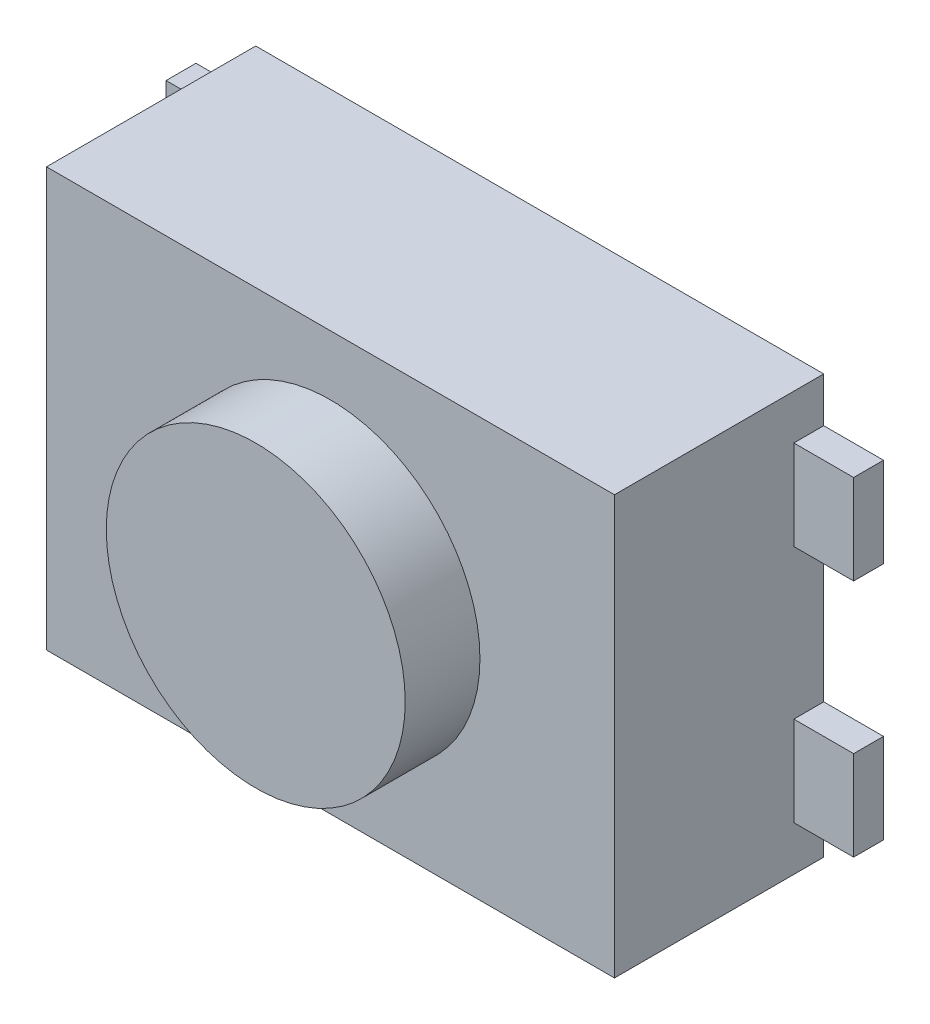
ISO-10303-21;
HEADER;
FILE_DESCRIPTION(('STEP AP214'),'2;1');
FILE_NAME('part.step','',(''),(''),'','','');
FILE_SCHEMA(('AUTOMOTIVE_DESIGN { 1 0 10303 214 1 1 1 1 }'));
ENDSEC;
DATA;
#1=APPLICATION_CONTEXT('core data for automotive mechanical design processes');
#2=APPLICATION_PROTOCOL_DEFINITION('international standard','automotive_design',2000,#1);
#3=PRODUCT_CONTEXT('',#1,'mechanical');
#4=PRODUCT('Part','Part','',(#3));
#5=PRODUCT_RELATED_PRODUCT_CATEGORY('part','',(#4));
#6=PRODUCT_DEFINITION_FORMATION('','',#4);
#7=PRODUCT_DEFINITION_CONTEXT('part definition',#1,'design');
#8=PRODUCT_DEFINITION('design','',#6,#7);
#9=PRODUCT_DEFINITION_SHAPE('','',#8);
#10=(LENGTH_UNIT() NAMED_UNIT(*) SI_UNIT(.MILLI.,.METRE.));
#11=(NAMED_UNIT(*) PLANE_ANGLE_UNIT() SI_UNIT($,.RADIAN.));
#12=(NAMED_UNIT(*) SI_UNIT($,.STERADIAN.) SOLID_ANGLE_UNIT());
#13=UNCERTAINTY_MEASURE_WITH_UNIT(LENGTH_MEASURE(1.E-05),#10,'distance_accuracy_value','');
#14=(GEOMETRIC_REPRESENTATION_CONTEXT(3) GLOBAL_UNCERTAINTY_ASSIGNED_CONTEXT((#13)) GLOBAL_UNIT_ASSIGNED_CONTEXT((#10,
#11,#12)) REPRESENTATION_CONTEXT('',''));
#15=CARTESIAN_POINT('',(0.,0.,0.));
#16=DIRECTION('',(0.,0.,1.));
#17=DIRECTION('',(1.,0.,0.));
#18=AXIS2_PLACEMENT_3D('',#15,#16,#17);
#19=CARTESIAN_POINT('',(2.1,0.8,0.));
#20=DIRECTION('',(0.,0.,1.));
#21=DIRECTION('',(1.,0.,0.));
#22=AXIS2_PLACEMENT_3D('',#19,#20,#21);
#23=PLANE('',#22);
#24=DIRECTION('',(-1.,0.,0.));
#25=VECTOR('',#24,1.);
#26=CARTESIAN_POINT('',(2.3,1.1,0.));
#27=LINE('',#26,#25);
#28=CARTESIAN_POINT('',(2.3,1.1,0.));
#29=VERTEX_POINT('',#28);
#30=CARTESIAN_POINT('',(1.9,1.1,0.));
#31=VERTEX_POINT('',#30);
#32=EDGE_CURVE('P0_E78',#29,#31,#27,.T.);
#33=ORIENTED_EDGE('',*,*,#32,.F.);
#34=DIRECTION('',(0.,1.,0.));
#35=VECTOR('',#34,1.);
#36=CARTESIAN_POINT('',(2.3,0.5,0.));
#37=LINE('',#36,#35);
#38=CARTESIAN_POINT('',(2.3,0.5,0.));
#39=VERTEX_POINT('',#38);
#40=EDGE_CURVE('P0_E54',#39,#29,#37,.T.);
#41=ORIENTED_EDGE('',*,*,#40,.F.);
#42=DIRECTION('',(1.,0.,0.));
#43=VECTOR('',#42,1.);
#44=CARTESIAN_POINT('',(1.9,0.5,0.));
#45=LINE('',#44,#43);
#46=CARTESIAN_POINT('',(1.9,0.5,0.));
#47=VERTEX_POINT('',#46);
#48=EDGE_CURVE('P0_E56',#47,#39,#45,.T.);
#49=ORIENTED_EDGE('',*,*,#48,.F.);
#50=DIRECTION('',(0.,1.,0.));
#51=VECTOR('',#50,1.);
#52=CARTESIAN_POINT('',(1.9,1.1,0.));
#53=LINE('',#52,#51);
#54=EDGE_CURVE('P0_E19',#31,#47,#53,.F.);
#55=ORIENTED_EDGE('',*,*,#54,.F.);
#56=EDGE_LOOP('',(#33,#41,#49,#55));
#57=FACE_BOUND('',#56,.T.);
#58=ADVANCED_FACE('P0_F16',(#57),#23,.F.);
#59=CARTESIAN_POINT('',(1.9,1.1,0.));
#60=DIRECTION('',(-1.,0.,0.));
#61=DIRECTION('',(0.,0.,1.));
#62=AXIS2_PLACEMENT_3D('',#59,#60,#61);
#63=PLANE('',#62);
#64=DIRECTION('',(0.,1.,0.));
#65=VECTOR('',#64,1.);
#66=CARTESIAN_POINT('',(1.9,0.8,0.2));
#67=LINE('',#66,#65);
#68=CARTESIAN_POINT('',(1.9,1.1,0.2));
#69=VERTEX_POINT('',#68);
#70=CARTESIAN_POINT('',(1.9,0.5,0.2));
#71=VERTEX_POINT('',#70);
#72=EDGE_CURVE('P0_E82',#69,#71,#67,.F.);
#73=ORIENTED_EDGE('',*,*,#72,.F.);
#74=DIRECTION('',(0.,0.,1.));
#75=VECTOR('',#74,1.);
#76=CARTESIAN_POINT('',(1.9,1.1,0.));
#77=LINE('',#76,#75);
#78=EDGE_CURVE('P0_E67',#31,#69,#77,.T.);
#79=ORIENTED_EDGE('',*,*,#78,.F.);
#80=ORIENTED_EDGE('',*,*,#54,.T.);
#81=DIRECTION('',(0.,0.,-1.));
#82=VECTOR('',#81,1.);
#83=CARTESIAN_POINT('',(1.9,0.5,0.));
#84=LINE('',#83,#82);
#85=EDGE_CURVE('P0_E62',#71,#47,#84,.T.);
#86=ORIENTED_EDGE('',*,*,#85,.F.);
#87=EDGE_LOOP('',(#73,#79,#80,#86));
#88=FACE_BOUND('',#87,.T.);
#89=ADVANCED_FACE('P0_F64',(#88),#63,.T.);
#90=CARTESIAN_POINT('',(1.9,0.5,0.));
#91=DIRECTION('',(0.,-1.,0.));
#92=DIRECTION('',(0.,0.,-1.));
#93=AXIS2_PLACEMENT_3D('',#90,#91,#92);
#94=PLANE('',#93);
#95=DIRECTION('',(1.,0.,0.));
#96=VECTOR('',#95,1.);
#97=CARTESIAN_POINT('',(2.1,0.5,0.2));
#98=LINE('',#97,#96);
#99=CARTESIAN_POINT('',(2.3,0.5,0.2));
#100=VERTEX_POINT('',#99);
#101=EDGE_CURVE('P0_E71',#71,#100,#98,.T.);
#102=ORIENTED_EDGE('',*,*,#101,.F.);
#103=ORIENTED_EDGE('',*,*,#85,.T.);
#104=ORIENTED_EDGE('',*,*,#48,.T.);
#105=DIRECTION('',(0.,0.,-1.));
#106=VECTOR('',#105,1.);
#107=CARTESIAN_POINT('',(2.3,0.5,0.));
#108=LINE('',#107,#106);
#109=EDGE_CURVE('P0_E74',#100,#39,#108,.T.);
#110=ORIENTED_EDGE('',*,*,#109,.F.);
#111=EDGE_LOOP('',(#102,#103,#104,#110));
#112=FACE_BOUND('',#111,.T.);
#113=ADVANCED_FACE('P0_F69',(#112),#94,.T.);
#114=CARTESIAN_POINT('',(2.3,0.5,0.));
#115=DIRECTION('',(1.,0.,0.));
#116=DIRECTION('',(0.,0.,-1.));
#117=AXIS2_PLACEMENT_3D('',#114,#115,#116);
#118=PLANE('',#117);
#119=DIRECTION('',(0.,1.,0.));
#120=VECTOR('',#119,1.);
#121=CARTESIAN_POINT('',(2.3,0.8,0.2));
#122=LINE('',#121,#120);
#123=CARTESIAN_POINT('',(2.3,1.1,0.2));
#124=VERTEX_POINT('',#123);
#125=EDGE_CURVE('P0_E25',#100,#124,#122,.T.);
#126=ORIENTED_EDGE('',*,*,#125,.F.);
#127=ORIENTED_EDGE('',*,*,#109,.T.);
#128=ORIENTED_EDGE('',*,*,#40,.T.);
#129=DIRECTION('',(0.,0.,1.));
#130=VECTOR('',#129,1.);
#131=CARTESIAN_POINT('',(2.3,1.1,0.));
#132=LINE('',#131,#130);
#133=EDGE_CURVE('P0_E34',#124,#29,#132,.F.);
#134=ORIENTED_EDGE('',*,*,#133,.F.);
#135=EDGE_LOOP('',(#126,#127,#128,#134));
#136=FACE_BOUND('',#135,.T.);
#137=ADVANCED_FACE('P0_F88',(#136),#118,.T.);
#138=CARTESIAN_POINT('',(2.3,1.1,0.));
#139=DIRECTION('',(0.,1.,0.));
#140=DIRECTION('',(-1.,0.,0.));
#141=AXIS2_PLACEMENT_3D('',#138,#139,#140);
#142=PLANE('',#141);
#143=DIRECTION('',(1.,0.,0.));
#144=VECTOR('',#143,1.);
#145=CARTESIAN_POINT('',(2.1,1.1,0.2));
#146=LINE('',#145,#144);
#147=EDGE_CURVE('P0_E11',#124,#69,#146,.F.);
#148=ORIENTED_EDGE('',*,*,#147,.F.);
#149=ORIENTED_EDGE('',*,*,#133,.T.);
#150=ORIENTED_EDGE('',*,*,#32,.T.);
#151=ORIENTED_EDGE('',*,*,#78,.T.);
#152=EDGE_LOOP('',(#148,#149,#150,#151));
#153=FACE_BOUND('',#152,.T.);
#154=ADVANCED_FACE('P0_F90',(#153),#142,.T.);
#155=CARTESIAN_POINT('',(2.1,0.8,0.2));
#156=DIRECTION('',(0.,0.,1.));
#157=DIRECTION('',(1.,0.,0.));
#158=AXIS2_PLACEMENT_3D('',#155,#156,#157);
#159=PLANE('',#158);
#160=ORIENTED_EDGE('',*,*,#125,.T.);
#161=ORIENTED_EDGE('',*,*,#147,.T.);
#162=ORIENTED_EDGE('',*,*,#72,.T.);
#163=ORIENTED_EDGE('',*,*,#101,.T.);
#164=EDGE_LOOP('',(#160,#161,#162,#163));
#165=FACE_BOUND('',#164,.T.);
#166=ADVANCED_FACE('P0_F87',(#165),#159,.T.);
#167=CLOSED_SHELL('',(#58,#89,#113,#137,#154,#166));
#168=MANIFOLD_SOLID_BREP('P0_B1',#167);
#169=CARTESIAN_POINT('',(-2.1,-0.8,0.));
#170=DIRECTION('',(0.,0.,1.));
#171=DIRECTION('',(1.,0.,0.));
#172=AXIS2_PLACEMENT_3D('',#169,#170,#171);
#173=PLANE('',#172);
#174=DIRECTION('',(1.,0.,0.));
#175=VECTOR('',#174,1.);
#176=CARTESIAN_POINT('',(-2.3,-1.1,0.));
#177=LINE('',#176,#175);
#178=CARTESIAN_POINT('',(-2.3,-1.1,0.));
#179=VERTEX_POINT('',#178);
#180=CARTESIAN_POINT('',(-1.9,-1.1,0.));
#181=VERTEX_POINT('',#180);
#182=EDGE_CURVE('P1_E78',#179,#181,#177,.T.);
#183=ORIENTED_EDGE('',*,*,#182,.F.);
#184=DIRECTION('',(0.,-1.,0.));
#185=VECTOR('',#184,1.);
#186=CARTESIAN_POINT('',(-2.3,-0.500000000000001,0.));
#187=LINE('',#186,#185);
#188=CARTESIAN_POINT('',(-2.3,-0.500000000000001,0.));
#189=VERTEX_POINT('',#188);
#190=EDGE_CURVE('P1_E54',#189,#179,#187,.T.);
#191=ORIENTED_EDGE('',*,*,#190,.F.);
#192=DIRECTION('',(-1.,0.,0.));
#193=VECTOR('',#192,1.);
#194=CARTESIAN_POINT('',(-1.9,-0.500000000000001,0.));
#195=LINE('',#194,#193);
#196=CARTESIAN_POINT('',(-1.9,-0.500000000000001,0.));
#197=VERTEX_POINT('',#196);
#198=EDGE_CURVE('P1_E56',#197,#189,#195,.T.);
#199=ORIENTED_EDGE('',*,*,#198,.F.);
#200=DIRECTION('',(0.,1.,0.));
#201=VECTOR('',#200,1.);
#202=CARTESIAN_POINT('',(-1.9,-1.1,0.));
#203=LINE('',#202,#201);
#204=EDGE_CURVE('P1_E19',#181,#197,#203,.T.);
#205=ORIENTED_EDGE('',*,*,#204,.F.);
#206=EDGE_LOOP('',(#183,#191,#199,#205));
#207=FACE_BOUND('',#206,.T.);
#208=ADVANCED_FACE('P1_F16',(#207),#173,.F.);
#209=CARTESIAN_POINT('',(-1.9,-1.1,0.));
#210=DIRECTION('',(1.,0.,0.));
#211=DIRECTION('',(0.,0.,-1.));
#212=AXIS2_PLACEMENT_3D('',#209,#210,#211);
#213=PLANE('',#212);
#214=DIRECTION('',(0.,1.,0.));
#215=VECTOR('',#214,1.);
#216=CARTESIAN_POINT('',(-1.9,-0.8,0.2));
#217=LINE('',#216,#215);
#218=CARTESIAN_POINT('',(-1.9,-1.1,0.2));
#219=VERTEX_POINT('',#218);
#220=CARTESIAN_POINT('',(-1.9,-0.500000000000001,0.2));
#221=VERTEX_POINT('',#220);
#222=EDGE_CURVE('P1_E82',#219,#221,#217,.T.);
#223=ORIENTED_EDGE('',*,*,#222,.F.);
#224=DIRECTION('',(0.,0.,-1.));
#225=VECTOR('',#224,1.);
#226=CARTESIAN_POINT('',(-1.9,-1.1,0.));
#227=LINE('',#226,#225);
#228=EDGE_CURVE('P1_E67',#181,#219,#227,.F.);
#229=ORIENTED_EDGE('',*,*,#228,.F.);
#230=ORIENTED_EDGE('',*,*,#204,.T.);
#231=DIRECTION('',(0.,0.,1.));
#232=VECTOR('',#231,1.);
#233=CARTESIAN_POINT('',(-1.9,-0.500000000000001,0.));
#234=LINE('',#233,#232);
#235=EDGE_CURVE('P1_E62',#221,#197,#234,.F.);
#236=ORIENTED_EDGE('',*,*,#235,.F.);
#237=EDGE_LOOP('',(#223,#229,#230,#236));
#238=FACE_BOUND('',#237,.T.);
#239=ADVANCED_FACE('P1_F64',(#238),#213,.T.);
#240=CARTESIAN_POINT('',(-1.9,-0.500000000000001,0.));
#241=DIRECTION('',(0.,1.,0.));
#242=DIRECTION('',(-1.,0.,0.));
#243=AXIS2_PLACEMENT_3D('',#240,#241,#242);
#244=PLANE('',#243);
#245=DIRECTION('',(1.,0.,0.));
#246=VECTOR('',#245,1.);
#247=CARTESIAN_POINT('',(-2.1,-0.500000000000001,0.2));
#248=LINE('',#247,#246);
#249=CARTESIAN_POINT('',(-2.3,-0.500000000000001,0.2));
#250=VERTEX_POINT('',#249);
#251=EDGE_CURVE('P1_E71',#221,#250,#248,.F.);
#252=ORIENTED_EDGE('',*,*,#251,.F.);
#253=ORIENTED_EDGE('',*,*,#235,.T.);
#254=ORIENTED_EDGE('',*,*,#198,.T.);
#255=DIRECTION('',(0.,0.,1.));
#256=VECTOR('',#255,1.);
#257=CARTESIAN_POINT('',(-2.3,-0.500000000000001,0.));
#258=LINE('',#257,#256);
#259=EDGE_CURVE('P1_E74',#250,#189,#258,.F.);
#260=ORIENTED_EDGE('',*,*,#259,.F.);
#261=EDGE_LOOP('',(#252,#253,#254,#260));
#262=FACE_BOUND('',#261,.T.);
#263=ADVANCED_FACE('P1_F69',(#262),#244,.T.);
#264=CARTESIAN_POINT('',(-2.3,-0.500000000000001,0.));
#265=DIRECTION('',(-1.,0.,0.));
#266=DIRECTION('',(0.,-1.,0.));
#267=AXIS2_PLACEMENT_3D('',#264,#265,#266);
#268=PLANE('',#267);
#269=DIRECTION('',(0.,1.,0.));
#270=VECTOR('',#269,1.);
#271=CARTESIAN_POINT('',(-2.3,-0.8,0.2));
#272=LINE('',#271,#270);
#273=CARTESIAN_POINT('',(-2.3,-1.1,0.2));
#274=VERTEX_POINT('',#273);
#275=EDGE_CURVE('P1_E25',#250,#274,#272,.F.);
#276=ORIENTED_EDGE('',*,*,#275,.F.);
#277=ORIENTED_EDGE('',*,*,#259,.T.);
#278=ORIENTED_EDGE('',*,*,#190,.T.);
#279=DIRECTION('',(0.,0.,-1.));
#280=VECTOR('',#279,1.);
#281=CARTESIAN_POINT('',(-2.3,-1.1,0.));
#282=LINE('',#281,#280);
#283=EDGE_CURVE('P1_E34',#274,#179,#282,.T.);
#284=ORIENTED_EDGE('',*,*,#283,.F.);
#285=EDGE_LOOP('',(#276,#277,#278,#284));
#286=FACE_BOUND('',#285,.T.);
#287=ADVANCED_FACE('P1_F88',(#286),#268,.T.);
#288=CARTESIAN_POINT('',(-2.3,-1.1,0.));
#289=DIRECTION('',(0.,-1.,0.));
#290=DIRECTION('',(0.,0.,-1.));
#291=AXIS2_PLACEMENT_3D('',#288,#289,#290);
#292=PLANE('',#291);
#293=DIRECTION('',(1.,0.,0.));
#294=VECTOR('',#293,1.);
#295=CARTESIAN_POINT('',(-2.1,-1.1,0.2));
#296=LINE('',#295,#294);
#297=EDGE_CURVE('P1_E11',#274,#219,#296,.T.);
#298=ORIENTED_EDGE('',*,*,#297,.F.);
#299=ORIENTED_EDGE('',*,*,#283,.T.);
#300=ORIENTED_EDGE('',*,*,#182,.T.);
#301=ORIENTED_EDGE('',*,*,#228,.T.);
#302=EDGE_LOOP('',(#298,#299,#300,#301));
#303=FACE_BOUND('',#302,.T.);
#304=ADVANCED_FACE('P1_F90',(#303),#292,.T.);
#305=CARTESIAN_POINT('',(-2.1,-0.8,0.2));
#306=DIRECTION('',(0.,0.,1.));
#307=DIRECTION('',(1.,0.,0.));
#308=AXIS2_PLACEMENT_3D('',#305,#306,#307);
#309=PLANE('',#308);
#310=ORIENTED_EDGE('',*,*,#275,.T.);
#311=ORIENTED_EDGE('',*,*,#297,.T.);
#312=ORIENTED_EDGE('',*,*,#222,.T.);
#313=ORIENTED_EDGE('',*,*,#251,.T.);
#314=EDGE_LOOP('',(#310,#311,#312,#313));
#315=FACE_BOUND('',#314,.T.);
#316=ADVANCED_FACE('P1_F87',(#315),#309,.T.);
#317=CLOSED_SHELL('',(#208,#239,#263,#287,#304,#316));
#318=MANIFOLD_SOLID_BREP('P1_B1',#317);
#319=CARTESIAN_POINT('',(0.,0.,1.9));
#320=DIRECTION('',(0.,0.,1.));
#321=DIRECTION('',(1.,0.,0.));
#322=AXIS2_PLACEMENT_3D('',#319,#320,#321);
#323=PLANE('',#322);
#324=CARTESIAN_POINT('',(0.,0.,1.9));
#325=DIRECTION('',(0.,0.,1.));
#326=DIRECTION('',(1.,0.,0.));
#327=AXIS2_PLACEMENT_3D('',#324,#325,#326);
#328=CIRCLE('',#327,1.);
#329=CARTESIAN_POINT('',(1.,0.,1.9));
#330=VERTEX_POINT('',#329);
#331=EDGE_CURVE('P2_E17',#330,#330,#328,.F.);
#332=ORIENTED_EDGE('',*,*,#331,.F.);
#333=EDGE_LOOP('',(#332));
#334=FACE_BOUND('',#333,.T.);
#335=ADVANCED_FACE('P2_F14',(#334),#323,.T.);
#336=CARTESIAN_POINT('',(0.,0.,1.4));
#337=DIRECTION('',(0.,0.,1.));
#338=DIRECTION('',(1.,0.,0.));
#339=AXIS2_PLACEMENT_3D('',#336,#337,#338);
#340=PLANE('',#339);
#341=CARTESIAN_POINT('',(0.,0.,1.4));
#342=DIRECTION('',(0.,0.,1.));
#343=DIRECTION('',(1.,0.,0.));
#344=AXIS2_PLACEMENT_3D('',#341,#342,#343);
#345=CIRCLE('',#344,1.);
#346=CARTESIAN_POINT('',(1.,0.,1.4));
#347=VERTEX_POINT('',#346);
#348=EDGE_CURVE('P2_E10',#347,#347,#345,.T.);
#349=ORIENTED_EDGE('',*,*,#348,.F.);
#350=EDGE_LOOP('',(#349));
#351=FACE_BOUND('',#350,.T.);
#352=ADVANCED_FACE('P2_F29',(#351),#340,.F.);
#353=CARTESIAN_POINT('',(0.,0.,1.4));
#354=DIRECTION('',(0.,0.,1.));
#355=DIRECTION('',(1.,0.,0.));
#356=AXIS2_PLACEMENT_3D('',#353,#354,#355);
#357=CYLINDRICAL_SURFACE('',#356,1.);
#358=ORIENTED_EDGE('',*,*,#348,.T.);
#359=EDGE_LOOP('',(#358));
#360=FACE_BOUND('',#359,.T.);
#361=ORIENTED_EDGE('',*,*,#331,.T.);
#362=EDGE_LOOP('',(#361));
#363=FACE_BOUND('',#362,.T.);
#364=ADVANCED_FACE('P2_F26',(#360,#363),#357,.T.);
#365=CLOSED_SHELL('',(#335,#352,#364));
#366=MANIFOLD_SOLID_BREP('P2_B1',#365);
#367=CARTESIAN_POINT('',(2.1,-0.8,0.));
#368=DIRECTION('',(0.,0.,1.));
#369=DIRECTION('',(1.,0.,0.));
#370=AXIS2_PLACEMENT_3D('',#367,#368,#369);
#371=PLANE('',#370);
#372=DIRECTION('',(0.,1.,0.));
#373=VECTOR('',#372,1.);
#374=CARTESIAN_POINT('',(2.3,-1.1,0.));
#375=LINE('',#374,#373);
#376=CARTESIAN_POINT('',(2.3,-1.1,0.));
#377=VERTEX_POINT('',#376);
#378=CARTESIAN_POINT('',(2.3,-0.5,0.));
#379=VERTEX_POINT('',#378);
#380=EDGE_CURVE('P3_E78',#377,#379,#375,.T.);
#381=ORIENTED_EDGE('',*,*,#380,.F.);
#382=DIRECTION('',(1.,0.,0.));
#383=VECTOR('',#382,1.);
#384=CARTESIAN_POINT('',(1.9,-1.1,0.));
#385=LINE('',#384,#383);
#386=CARTESIAN_POINT('',(1.9,-1.1,0.));
#387=VERTEX_POINT('',#386);
#388=EDGE_CURVE('P3_E54',#387,#377,#385,.T.);
#389=ORIENTED_EDGE('',*,*,#388,.F.);
#390=DIRECTION('',(0.,1.,0.));
#391=VECTOR('',#390,1.);
#392=CARTESIAN_POINT('',(1.9,-0.5,0.));
#393=LINE('',#392,#391);
#394=CARTESIAN_POINT('',(1.9,-0.5,0.));
#395=VERTEX_POINT('',#394);
#396=EDGE_CURVE('P3_E56',#395,#387,#393,.F.);
#397=ORIENTED_EDGE('',*,*,#396,.F.);
#398=DIRECTION('',(1.,0.,0.));
#399=VECTOR('',#398,1.);
#400=CARTESIAN_POINT('',(2.3,-0.5,0.));
#401=LINE('',#400,#399);
#402=EDGE_CURVE('P3_E19',#379,#395,#401,.F.);
#403=ORIENTED_EDGE('',*,*,#402,.F.);
#404=EDGE_LOOP('',(#381,#389,#397,#403));
#405=FACE_BOUND('',#404,.T.);
#406=ADVANCED_FACE('P3_F16',(#405),#371,.F.);
#407=CARTESIAN_POINT('',(2.3,-0.5,0.));
#408=DIRECTION('',(0.,1.,0.));
#409=DIRECTION('',(0.,0.,1.));
#410=AXIS2_PLACEMENT_3D('',#407,#408,#409);
#411=PLANE('',#410);
#412=DIRECTION('',(1.,0.,0.));
#413=VECTOR('',#412,1.);
#414=CARTESIAN_POINT('',(2.1,-0.5,0.2));
#415=LINE('',#414,#413);
#416=CARTESIAN_POINT('',(2.3,-0.5,0.2));
#417=VERTEX_POINT('',#416);
#418=CARTESIAN_POINT('',(1.9,-0.5,0.2));
#419=VERTEX_POINT('',#418);
#420=EDGE_CURVE('P3_E82',#417,#419,#415,.F.);
#421=ORIENTED_EDGE('',*,*,#420,.F.);
#422=DIRECTION('',(0.,0.,1.));
#423=VECTOR('',#422,1.);
#424=CARTESIAN_POINT('',(2.3,-0.5,0.));
#425=LINE('',#424,#423);
#426=EDGE_CURVE('P3_E67',#379,#417,#425,.T.);
#427=ORIENTED_EDGE('',*,*,#426,.F.);
#428=ORIENTED_EDGE('',*,*,#402,.T.);
#429=DIRECTION('',(0.,0.,1.));
#430=VECTOR('',#429,1.);
#431=CARTESIAN_POINT('',(1.9,-0.5,0.));
#432=LINE('',#431,#430);
#433=EDGE_CURVE('P3_E62',#419,#395,#432,.F.);
#434=ORIENTED_EDGE('',*,*,#433,.F.);
#435=EDGE_LOOP('',(#421,#427,#428,#434));
#436=FACE_BOUND('',#435,.T.);
#437=ADVANCED_FACE('P3_F64',(#436),#411,.T.);
#438=CARTESIAN_POINT('',(1.9,-0.5,0.));
#439=DIRECTION('',(-1.,0.,0.));
#440=DIRECTION('',(0.,0.,1.));
#441=AXIS2_PLACEMENT_3D('',#438,#439,#440);
#442=PLANE('',#441);
#443=DIRECTION('',(0.,1.,0.));
#444=VECTOR('',#443,1.);
#445=CARTESIAN_POINT('',(1.9,-0.8,0.2));
#446=LINE('',#445,#444);
#447=CARTESIAN_POINT('',(1.9,-1.1,0.2));
#448=VERTEX_POINT('',#447);
#449=EDGE_CURVE('P3_E71',#419,#448,#446,.F.);
#450=ORIENTED_EDGE('',*,*,#449,.F.);
#451=ORIENTED_EDGE('',*,*,#433,.T.);
#452=ORIENTED_EDGE('',*,*,#396,.T.);
#453=DIRECTION('',(0.,0.,1.));
#454=VECTOR('',#453,1.);
#455=CARTESIAN_POINT('',(1.9,-1.1,0.));
#456=LINE('',#455,#454);
#457=EDGE_CURVE('P3_E74',#448,#387,#456,.F.);
#458=ORIENTED_EDGE('',*,*,#457,.F.);
#459=EDGE_LOOP('',(#450,#451,#452,#458));
#460=FACE_BOUND('',#459,.T.);
#461=ADVANCED_FACE('P3_F69',(#460),#442,.T.);
#462=CARTESIAN_POINT('',(1.9,-1.1,0.));
#463=DIRECTION('',(0.,-1.,0.));
#464=DIRECTION('',(1.,0.,0.));
#465=AXIS2_PLACEMENT_3D('',#462,#463,#464);
#466=PLANE('',#465);
#467=DIRECTION('',(1.,0.,0.));
#468=VECTOR('',#467,1.);
#469=CARTESIAN_POINT('',(2.1,-1.1,0.2));
#470=LINE('',#469,#468);
#471=CARTESIAN_POINT('',(2.3,-1.1,0.2));
#472=VERTEX_POINT('',#471);
#473=EDGE_CURVE('P3_E25',#448,#472,#470,.T.);
#474=ORIENTED_EDGE('',*,*,#473,.F.);
#475=ORIENTED_EDGE('',*,*,#457,.T.);
#476=ORIENTED_EDGE('',*,*,#388,.T.);
#477=DIRECTION('',(0.,0.,1.));
#478=VECTOR('',#477,1.);
#479=CARTESIAN_POINT('',(2.3,-1.1,0.));
#480=LINE('',#479,#478);
#481=EDGE_CURVE('P3_E34',#472,#377,#480,.F.);
#482=ORIENTED_EDGE('',*,*,#481,.F.);
#483=EDGE_LOOP('',(#474,#475,#476,#482));
#484=FACE_BOUND('',#483,.T.);
#485=ADVANCED_FACE('P3_F88',(#484),#466,.T.);
#486=CARTESIAN_POINT('',(2.3,-1.1,0.));
#487=DIRECTION('',(1.,0.,0.));
#488=DIRECTION('',(0.,1.,0.));
#489=AXIS2_PLACEMENT_3D('',#486,#487,#488);
#490=PLANE('',#489);
#491=DIRECTION('',(0.,1.,0.));
#492=VECTOR('',#491,1.);
#493=CARTESIAN_POINT('',(2.3,-0.8,0.2));
#494=LINE('',#493,#492);
#495=EDGE_CURVE('P3_E11',#472,#417,#494,.T.);
#496=ORIENTED_EDGE('',*,*,#495,.F.);
#497=ORIENTED_EDGE('',*,*,#481,.T.);
#498=ORIENTED_EDGE('',*,*,#380,.T.);
#499=ORIENTED_EDGE('',*,*,#426,.T.);
#500=EDGE_LOOP('',(#496,#497,#498,#499));
#501=FACE_BOUND('',#500,.T.);
#502=ADVANCED_FACE('P3_F90',(#501),#490,.T.);
#503=CARTESIAN_POINT('',(2.1,-0.8,0.2));
#504=DIRECTION('',(0.,0.,1.));
#505=DIRECTION('',(1.,0.,0.));
#506=AXIS2_PLACEMENT_3D('',#503,#504,#505);
#507=PLANE('',#506);
#508=ORIENTED_EDGE('',*,*,#473,.T.);
#509=ORIENTED_EDGE('',*,*,#495,.T.);
#510=ORIENTED_EDGE('',*,*,#420,.T.);
#511=ORIENTED_EDGE('',*,*,#449,.T.);
#512=EDGE_LOOP('',(#508,#509,#510,#511));
#513=FACE_BOUND('',#512,.T.);
#514=ADVANCED_FACE('P3_F87',(#513),#507,.T.);
#515=CLOSED_SHELL('',(#406,#437,#461,#485,#502,#514));
#516=MANIFOLD_SOLID_BREP('P3_B1',#515);
#517=CARTESIAN_POINT('',(0.,0.,0.));
#518=DIRECTION('',(0.,0.,1.));
#519=DIRECTION('',(1.,0.,0.));
#520=AXIS2_PLACEMENT_3D('',#517,#518,#519);
#521=PLANE('',#520);
#522=DIRECTION('',(0.,1.,0.));
#523=VECTOR('',#522,1.);
#524=CARTESIAN_POINT('',(-1.9,1.4,0.));
#525=LINE('',#524,#523);
#526=CARTESIAN_POINT('',(-1.9,1.4,0.));
#527=VERTEX_POINT('',#526);
#528=CARTESIAN_POINT('',(-1.9,-1.4,0.));
#529=VERTEX_POINT('',#528);
#530=EDGE_CURVE('P4_E78',#527,#529,#525,.F.);
#531=ORIENTED_EDGE('',*,*,#530,.F.);
#532=DIRECTION('',(1.,0.,0.));
#533=VECTOR('',#532,1.);
#534=CARTESIAN_POINT('',(1.9,1.4,0.));
#535=LINE('',#534,#533);
#536=CARTESIAN_POINT('',(1.9,1.4,0.));
#537=VERTEX_POINT('',#536);
#538=EDGE_CURVE('P4_E54',#537,#527,#535,.F.);
#539=ORIENTED_EDGE('',*,*,#538,.F.);
#540=DIRECTION('',(0.,1.,0.));
#541=VECTOR('',#540,1.);
#542=CARTESIAN_POINT('',(1.9,-1.4,0.));
#543=LINE('',#542,#541);
#544=CARTESIAN_POINT('',(1.9,-1.4,0.));
#545=VERTEX_POINT('',#544);
#546=EDGE_CURVE('P4_E56',#545,#537,#543,.T.);
#547=ORIENTED_EDGE('',*,*,#546,.F.);
#548=DIRECTION('',(1.,0.,0.));
#549=VECTOR('',#548,1.);
#550=CARTESIAN_POINT('',(-1.9,-1.4,0.));
#551=LINE('',#550,#549);
#552=EDGE_CURVE('P4_E19',#529,#545,#551,.T.);
#553=ORIENTED_EDGE('',*,*,#552,.F.);
#554=EDGE_LOOP('',(#531,#539,#547,#553));
#555=FACE_BOUND('',#554,.T.);
#556=ADVANCED_FACE('P4_F16',(#555),#521,.F.);
#557=CARTESIAN_POINT('',(-1.9,-1.4,0.));
#558=DIRECTION('',(0.,-1.,0.));
#559=DIRECTION('',(0.,0.,-1.));
#560=AXIS2_PLACEMENT_3D('',#557,#558,#559);
#561=PLANE('',#560);
#562=DIRECTION('',(1.,0.,0.));
#563=VECTOR('',#562,1.);
#564=CARTESIAN_POINT('',(0.,-1.4,1.4));
#565=LINE('',#564,#563);
#566=CARTESIAN_POINT('',(-1.9,-1.4,1.4));
#567=VERTEX_POINT('',#566);
#568=CARTESIAN_POINT('',(1.9,-1.4,1.4));
#569=VERTEX_POINT('',#568);
#570=EDGE_CURVE('P4_E82',#567,#569,#565,.T.);
#571=ORIENTED_EDGE('',*,*,#570,.F.);
#572=DIRECTION('',(0.,0.,1.));
#573=VECTOR('',#572,1.);
#574=CARTESIAN_POINT('',(-1.9,-1.4,0.));
#575=LINE('',#574,#573);
#576=EDGE_CURVE('P4_E67',#529,#567,#575,.T.);
#577=ORIENTED_EDGE('',*,*,#576,.F.);
#578=ORIENTED_EDGE('',*,*,#552,.T.);
#579=DIRECTION('',(0.,0.,-1.));
#580=VECTOR('',#579,1.);
#581=CARTESIAN_POINT('',(1.9,-1.4,0.));
#582=LINE('',#581,#580);
#583=EDGE_CURVE('P4_E62',#569,#545,#582,.T.);
#584=ORIENTED_EDGE('',*,*,#583,.F.);
#585=EDGE_LOOP('',(#571,#577,#578,#584));
#586=FACE_BOUND('',#585,.T.);
#587=ADVANCED_FACE('P4_F64',(#586),#561,.T.);
#588=CARTESIAN_POINT('',(1.9,-1.4,0.));
#589=DIRECTION('',(1.,0.,0.));
#590=DIRECTION('',(0.,0.,-1.));
#591=AXIS2_PLACEMENT_3D('',#588,#589,#590);
#592=PLANE('',#591);
#593=DIRECTION('',(0.,1.,0.));
#594=VECTOR('',#593,1.);
#595=CARTESIAN_POINT('',(1.9,0.,1.4));
#596=LINE('',#595,#594);
#597=CARTESIAN_POINT('',(1.9,1.4,1.4));
#598=VERTEX_POINT('',#597);
#599=EDGE_CURVE('P4_E71',#569,#598,#596,.T.);
#600=ORIENTED_EDGE('',*,*,#599,.F.);
#601=ORIENTED_EDGE('',*,*,#583,.T.);
#602=ORIENTED_EDGE('',*,*,#546,.T.);
#603=DIRECTION('',(0.,0.,1.));
#604=VECTOR('',#603,1.);
#605=CARTESIAN_POINT('',(1.9,1.4,0.));
#606=LINE('',#605,#604);
#607=EDGE_CURVE('P4_E74',#598,#537,#606,.F.);
#608=ORIENTED_EDGE('',*,*,#607,.F.);
#609=EDGE_LOOP('',(#600,#601,#602,#608));
#610=FACE_BOUND('',#609,.T.);
#611=ADVANCED_FACE('P4_F69',(#610),#592,.T.);
#612=CARTESIAN_POINT('',(1.9,1.4,0.));
#613=DIRECTION('',(0.,1.,0.));
#614=DIRECTION('',(0.,0.,1.));
#615=AXIS2_PLACEMENT_3D('',#612,#613,#614);
#616=PLANE('',#615);
#617=DIRECTION('',(1.,0.,0.));
#618=VECTOR('',#617,1.);
#619=CARTESIAN_POINT('',(0.,1.4,1.4));
#620=LINE('',#619,#618);
#621=CARTESIAN_POINT('',(-1.9,1.4,1.4));
#622=VERTEX_POINT('',#621);
#623=EDGE_CURVE('P4_E25',#598,#622,#620,.F.);
#624=ORIENTED_EDGE('',*,*,#623,.F.);
#625=ORIENTED_EDGE('',*,*,#607,.T.);
#626=ORIENTED_EDGE('',*,*,#538,.T.);
#627=DIRECTION('',(0.,0.,1.));
#628=VECTOR('',#627,1.);
#629=CARTESIAN_POINT('',(-1.9,1.4,0.));
#630=LINE('',#629,#628);
#631=EDGE_CURVE('P4_E34',#622,#527,#630,.F.);
#632=ORIENTED_EDGE('',*,*,#631,.F.);
#633=EDGE_LOOP('',(#624,#625,#626,#632));
#634=FACE_BOUND('',#633,.T.);
#635=ADVANCED_FACE('P4_F88',(#634),#616,.T.);
#636=CARTESIAN_POINT('',(-1.9,1.4,0.));
#637=DIRECTION('',(-1.,0.,0.));
#638=DIRECTION('',(0.,0.,1.));
#639=AXIS2_PLACEMENT_3D('',#636,#637,#638);
#640=PLANE('',#639);
#641=DIRECTION('',(0.,1.,0.));
#642=VECTOR('',#641,1.);
#643=CARTESIAN_POINT('',(-1.9,0.,1.4));
#644=LINE('',#643,#642);
#645=EDGE_CURVE('P4_E11',#622,#567,#644,.F.);
#646=ORIENTED_EDGE('',*,*,#645,.F.);
#647=ORIENTED_EDGE('',*,*,#631,.T.);
#648=ORIENTED_EDGE('',*,*,#530,.T.);
#649=ORIENTED_EDGE('',*,*,#576,.T.);
#650=EDGE_LOOP('',(#646,#647,#648,#649));
#651=FACE_BOUND('',#650,.T.);
#652=ADVANCED_FACE('P4_F90',(#651),#640,.T.);
#653=CARTESIAN_POINT('',(0.,0.,1.4));
#654=DIRECTION('',(0.,0.,1.));
#655=DIRECTION('',(1.,0.,0.));
#656=AXIS2_PLACEMENT_3D('',#653,#654,#655);
#657=PLANE('',#656);
#658=ORIENTED_EDGE('',*,*,#623,.T.);
#659=ORIENTED_EDGE('',*,*,#645,.T.);
#660=ORIENTED_EDGE('',*,*,#570,.T.);
#661=ORIENTED_EDGE('',*,*,#599,.T.);
#662=EDGE_LOOP('',(#658,#659,#660,#661));
#663=FACE_BOUND('',#662,.T.);
#664=ADVANCED_FACE('P4_F87',(#663),#657,.T.);
#665=CLOSED_SHELL('',(#556,#587,#611,#635,#652,#664));
#666=MANIFOLD_SOLID_BREP('P4_B1',#665);
#667=CARTESIAN_POINT('',(-2.1,0.8,0.));
#668=DIRECTION('',(0.,0.,1.));
#669=DIRECTION('',(1.,0.,0.));
#670=AXIS2_PLACEMENT_3D('',#667,#668,#669);
#671=PLANE('',#670);
#672=DIRECTION('',(0.,1.,0.));
#673=VECTOR('',#672,1.);
#674=CARTESIAN_POINT('',(-2.3,1.1,0.));
#675=LINE('',#674,#673);
#676=CARTESIAN_POINT('',(-2.3,1.1,0.));
#677=VERTEX_POINT('',#676);
#678=CARTESIAN_POINT('',(-2.3,0.5,0.));
#679=VERTEX_POINT('',#678);
#680=EDGE_CURVE('P5_E78',#677,#679,#675,.F.);
#681=ORIENTED_EDGE('',*,*,#680,.F.);
#682=DIRECTION('',(1.,0.,0.));
#683=VECTOR('',#682,1.);
#684=CARTESIAN_POINT('',(-1.9,1.1,0.));
#685=LINE('',#684,#683);
#686=CARTESIAN_POINT('',(-1.9,1.1,0.));
#687=VERTEX_POINT('',#686);
#688=EDGE_CURVE('P5_E54',#687,#677,#685,.F.);
#689=ORIENTED_EDGE('',*,*,#688,.F.);
#690=DIRECTION('',(0.,1.,0.));
#691=VECTOR('',#690,1.);
#692=CARTESIAN_POINT('',(-1.9,0.5,0.));
#693=LINE('',#692,#691);
#694=CARTESIAN_POINT('',(-1.9,0.5,0.));
#695=VERTEX_POINT('',#694);
#696=EDGE_CURVE('P5_E56',#695,#687,#693,.T.);
#697=ORIENTED_EDGE('',*,*,#696,.F.);
#698=DIRECTION('',(1.,0.,0.));
#699=VECTOR('',#698,1.);
#700=CARTESIAN_POINT('',(-2.3,0.5,0.));
#701=LINE('',#700,#699);
#702=EDGE_CURVE('P5_E19',#679,#695,#701,.T.);
#703=ORIENTED_EDGE('',*,*,#702,.F.);
#704=EDGE_LOOP('',(#681,#689,#697,#703));
#705=FACE_BOUND('',#704,.T.);
#706=ADVANCED_FACE('P5_F16',(#705),#671,.F.);
#707=CARTESIAN_POINT('',(-2.3,0.5,0.));
#708=DIRECTION('',(0.,-1.,0.));
#709=DIRECTION('',(1.,0.,0.));
#710=AXIS2_PLACEMENT_3D('',#707,#708,#709);
#711=PLANE('',#710);
#712=DIRECTION('',(1.,0.,0.));
#713=VECTOR('',#712,1.);
#714=CARTESIAN_POINT('',(-2.1,0.5,0.2));
#715=LINE('',#714,#713);
#716=CARTESIAN_POINT('',(-2.3,0.5,0.2));
#717=VERTEX_POINT('',#716);
#718=CARTESIAN_POINT('',(-1.9,0.5,0.2));
#719=VERTEX_POINT('',#718);
#720=EDGE_CURVE('P5_E82',#717,#719,#715,.T.);
#721=ORIENTED_EDGE('',*,*,#720,.F.);
#722=DIRECTION('',(0.,0.,1.));
#723=VECTOR('',#722,1.);
#724=CARTESIAN_POINT('',(-2.3,0.5,0.));
#725=LINE('',#724,#723);
#726=EDGE_CURVE('P5_E67',#679,#717,#725,.T.);
#727=ORIENTED_EDGE('',*,*,#726,.F.);
#728=ORIENTED_EDGE('',*,*,#702,.T.);
#729=DIRECTION('',(0.,0.,-1.));
#730=VECTOR('',#729,1.);
#731=CARTESIAN_POINT('',(-1.9,0.5,0.));
#732=LINE('',#731,#730);
#733=EDGE_CURVE('P5_E62',#719,#695,#732,.T.);
#734=ORIENTED_EDGE('',*,*,#733,.F.);
#735=EDGE_LOOP('',(#721,#727,#728,#734));
#736=FACE_BOUND('',#735,.T.);
#737=ADVANCED_FACE('P5_F64',(#736),#711,.T.);
#738=CARTESIAN_POINT('',(-1.9,0.5,0.));
#739=DIRECTION('',(1.,0.,0.));
#740=DIRECTION('',(0.,0.,-1.));
#741=AXIS2_PLACEMENT_3D('',#738,#739,#740);
#742=PLANE('',#741);
#743=DIRECTION('',(0.,1.,0.));
#744=VECTOR('',#743,1.);
#745=CARTESIAN_POINT('',(-1.9,0.8,0.2));
#746=LINE('',#745,#744);
#747=CARTESIAN_POINT('',(-1.9,1.1,0.2));
#748=VERTEX_POINT('',#747);
#749=EDGE_CURVE('P5_E71',#719,#748,#746,.T.);
#750=ORIENTED_EDGE('',*,*,#749,.F.);
#751=ORIENTED_EDGE('',*,*,#733,.T.);
#752=ORIENTED_EDGE('',*,*,#696,.T.);
#753=DIRECTION('',(0.,0.,1.));
#754=VECTOR('',#753,1.);
#755=CARTESIAN_POINT('',(-1.9,1.1,0.));
#756=LINE('',#755,#754);
#757=EDGE_CURVE('P5_E74',#748,#687,#756,.F.);
#758=ORIENTED_EDGE('',*,*,#757,.F.);
#759=EDGE_LOOP('',(#750,#751,#752,#758));
#760=FACE_BOUND('',#759,.T.);
#761=ADVANCED_FACE('P5_F69',(#760),#742,.T.);
#762=CARTESIAN_POINT('',(-1.9,1.1,0.));
#763=DIRECTION('',(0.,1.,0.));
#764=DIRECTION('',(0.,0.,1.));
#765=AXIS2_PLACEMENT_3D('',#762,#763,#764);
#766=PLANE('',#765);
#767=DIRECTION('',(1.,0.,0.));
#768=VECTOR('',#767,1.);
#769=CARTESIAN_POINT('',(-2.1,1.1,0.2));
#770=LINE('',#769,#768);
#771=CARTESIAN_POINT('',(-2.3,1.1,0.2));
#772=VERTEX_POINT('',#771);
#773=EDGE_CURVE('P5_E25',#748,#772,#770,.F.);
#774=ORIENTED_EDGE('',*,*,#773,.F.);
#775=ORIENTED_EDGE('',*,*,#757,.T.);
#776=ORIENTED_EDGE('',*,*,#688,.T.);
#777=DIRECTION('',(0.,0.,1.));
#778=VECTOR('',#777,1.);
#779=CARTESIAN_POINT('',(-2.3,1.1,0.));
#780=LINE('',#779,#778);
#781=EDGE_CURVE('P5_E34',#772,#677,#780,.F.);
#782=ORIENTED_EDGE('',*,*,#781,.F.);
#783=EDGE_LOOP('',(#774,#775,#776,#782));
#784=FACE_BOUND('',#783,.T.);
#785=ADVANCED_FACE('P5_F88',(#784),#766,.T.);
#786=CARTESIAN_POINT('',(-2.3,1.1,0.));
#787=DIRECTION('',(-1.,0.,0.));
#788=DIRECTION('',(0.,0.,1.));
#789=AXIS2_PLACEMENT_3D('',#786,#787,#788);
#790=PLANE('',#789);
#791=DIRECTION('',(0.,1.,0.));
#792=VECTOR('',#791,1.);
#793=CARTESIAN_POINT('',(-2.3,0.8,0.2));
#794=LINE('',#793,#792);
#795=EDGE_CURVE('P5_E11',#772,#717,#794,.F.);
#796=ORIENTED_EDGE('',*,*,#795,.F.);
#797=ORIENTED_EDGE('',*,*,#781,.T.);
#798=ORIENTED_EDGE('',*,*,#680,.T.);
#799=ORIENTED_EDGE('',*,*,#726,.T.);
#800=EDGE_LOOP('',(#796,#797,#798,#799));
#801=FACE_BOUND('',#800,.T.);
#802=ADVANCED_FACE('P5_F90',(#801),#790,.T.);
#803=CARTESIAN_POINT('',(-2.1,0.8,0.2));
#804=DIRECTION('',(0.,0.,1.));
#805=DIRECTION('',(1.,0.,0.));
#806=AXIS2_PLACEMENT_3D('',#803,#804,#805);
#807=PLANE('',#806);
#808=ORIENTED_EDGE('',*,*,#773,.T.);
#809=ORIENTED_EDGE('',*,*,#795,.T.);
#810=ORIENTED_EDGE('',*,*,#720,.T.);
#811=ORIENTED_EDGE('',*,*,#749,.T.);
#812=EDGE_LOOP('',(#808,#809,#810,#811));
#813=FACE_BOUND('',#812,.T.);
#814=ADVANCED_FACE('P5_F87',(#813),#807,.T.);
#815=CLOSED_SHELL('',(#706,#737,#761,#785,#802,#814));
#816=MANIFOLD_SOLID_BREP('P5_B1',#815);
#817=ADVANCED_BREP_SHAPE_REPRESENTATION('',(#18,#168,#318,#366,#516,#666,#816),#14);
#818=SHAPE_DEFINITION_REPRESENTATION(#9,#817);
ENDSEC;
END-ISO-10303-21;
